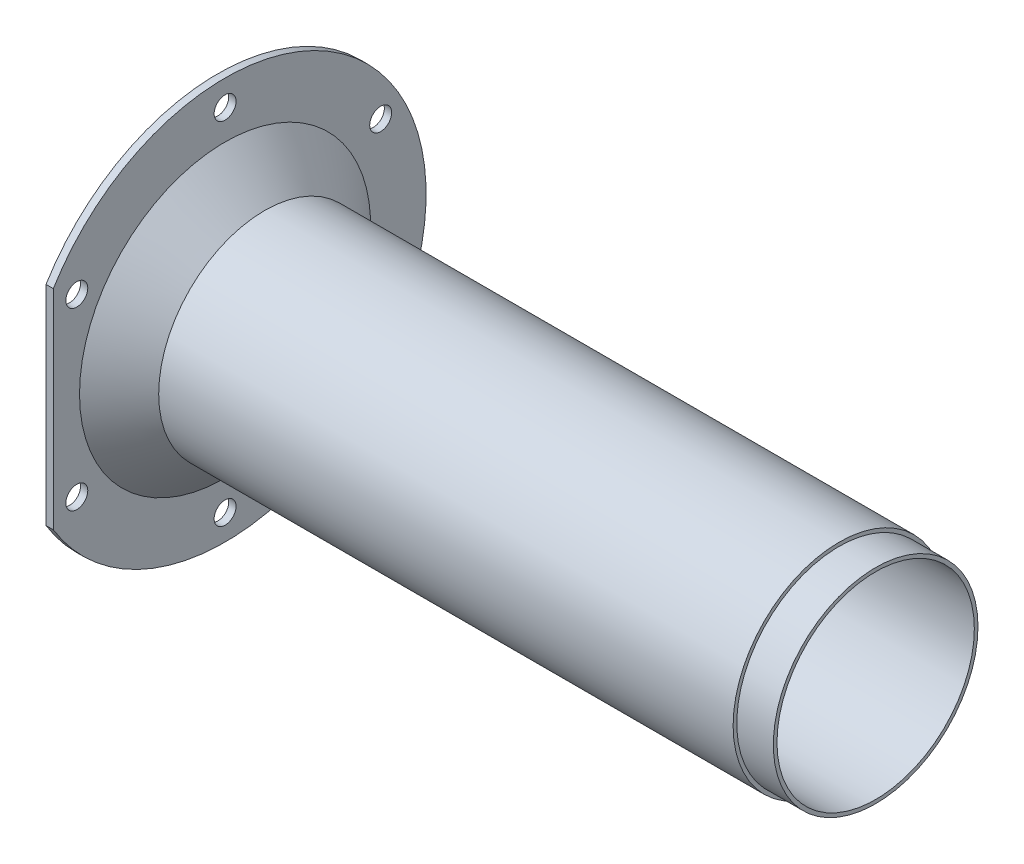
ISO-10303-21;
HEADER;
FILE_DESCRIPTION(('STEP AP214'),'2;1');
FILE_NAME('part.step','',(''),(''),'','','');
FILE_SCHEMA(('AUTOMOTIVE_DESIGN { 1 0 10303 214 1 1 1 1 }'));
ENDSEC;
DATA;
#1=APPLICATION_CONTEXT('core data for automotive mechanical design processes');
#2=APPLICATION_PROTOCOL_DEFINITION('international standard','automotive_design',2000,#1);
#3=PRODUCT_CONTEXT('',#1,'mechanical');
#4=PRODUCT('Part','Part','',(#3));
#5=PRODUCT_RELATED_PRODUCT_CATEGORY('part','',(#4));
#6=PRODUCT_DEFINITION_FORMATION('','',#4);
#7=PRODUCT_DEFINITION_CONTEXT('part definition',#1,'design');
#8=PRODUCT_DEFINITION('design','',#6,#7);
#9=PRODUCT_DEFINITION_SHAPE('','',#8);
#10=(LENGTH_UNIT() NAMED_UNIT(*) SI_UNIT(.MILLI.,.METRE.));
#11=(NAMED_UNIT(*) PLANE_ANGLE_UNIT() SI_UNIT($,.RADIAN.));
#12=(NAMED_UNIT(*) SI_UNIT($,.STERADIAN.) SOLID_ANGLE_UNIT());
#13=UNCERTAINTY_MEASURE_WITH_UNIT(LENGTH_MEASURE(1.E-05),#10,'distance_accuracy_value','');
#14=(GEOMETRIC_REPRESENTATION_CONTEXT(3) GLOBAL_UNCERTAINTY_ASSIGNED_CONTEXT((#13)) GLOBAL_UNIT_ASSIGNED_CONTEXT((#10,
#11,#12)) REPRESENTATION_CONTEXT('',''));
#15=CARTESIAN_POINT('',(0.,0.,0.));
#16=DIRECTION('',(0.,0.,1.));
#17=DIRECTION('',(1.,0.,0.));
#18=AXIS2_PLACEMENT_3D('',#15,#16,#17);
#19=CARTESIAN_POINT('',(-4.45390252457045E-13,0.,0.));
#20=DIRECTION('',(-1.,0.,0.));
#21=DIRECTION('',(0.,0.,1.));
#22=AXIS2_PLACEMENT_3D('',#19,#20,#21);
#23=CONICAL_SURFACE('',#22,19.4999999999996,0.7853981633973);
#24=CARTESIAN_POINT('',(6.,0.,0.));
#25=DIRECTION('',(1.,0.,0.));
#26=DIRECTION('',(0.,0.,-1.));
#27=AXIS2_PLACEMENT_3D('',#24,#25,#26);
#28=CIRCLE('',#27,13.5);
#29=CARTESIAN_POINT('',(6.,0.,-13.5));
#30=VERTEX_POINT('',#29);
#31=EDGE_CURVE('E52',#30,#30,#28,.T.);
#32=ORIENTED_EDGE('',*,*,#31,.T.);
#33=EDGE_LOOP('',(#32));
#34=FACE_BOUND('',#33,.T.);
#35=CARTESIAN_POINT('',(-4.44089209850063E-13,0.,0.));
#36=DIRECTION('',(-1.,0.,0.));
#37=DIRECTION('',(0.,0.,1.));
#38=AXIS2_PLACEMENT_3D('',#35,#36,#37);
#39=CIRCLE('',#38,19.4999999999996);
#40=CARTESIAN_POINT('',(-4.44089209850063E-13,0.,19.4999999999996));
#41=VERTEX_POINT('',#40);
#42=EDGE_CURVE('E20',#41,#41,#39,.T.);
#43=ORIENTED_EDGE('',*,*,#42,.T.);
#44=EDGE_LOOP('',(#43));
#45=FACE_BOUND('',#44,.T.);
#46=ADVANCED_FACE('F17',(#34,#45),#23,.F.);
#47=CARTESIAN_POINT('',(0.,0.,0.));
#48=DIRECTION('',(1.,0.,0.));
#49=DIRECTION('',(0.,0.,-1.));
#50=AXIS2_PLACEMENT_3D('',#47,#48,#49);
#51=PLANE('',#50);
#52=CARTESIAN_POINT('',(0.,-12.,20.28460969083));
#53=DIRECTION('',(1.,0.,0.));
#54=DIRECTION('',(0.,0.,-1.));
#55=AXIS2_PLACEMENT_3D('',#52,#53,#54);
#56=CIRCLE('',#55,1.5);
#57=CARTESIAN_POINT('',(0.,-12.,18.78460969083));
#58=VERTEX_POINT('',#57);
#59=EDGE_CURVE('E97',#58,#58,#56,.T.);
#60=ORIENTED_EDGE('',*,*,#59,.T.);
#61=EDGE_LOOP('',(#60));
#62=FACE_BOUND('',#61,.T.);
#63=CARTESIAN_POINT('',(0.,12.,20.28460969083));
#64=DIRECTION('',(1.,0.,0.));
#65=DIRECTION('',(0.,0.,-1.));
#66=AXIS2_PLACEMENT_3D('',#63,#64,#65);
#67=CIRCLE('',#66,1.5);
#68=CARTESIAN_POINT('',(0.,12.,18.78460969083));
#69=VERTEX_POINT('',#68);
#70=EDGE_CURVE('E100',#69,#69,#67,.T.);
#71=ORIENTED_EDGE('',*,*,#70,.T.);
#72=EDGE_LOOP('',(#71));
#73=FACE_BOUND('',#72,.T.);
#74=CARTESIAN_POINT('',(0.,23.9947911014,0.));
#75=DIRECTION('',(1.,0.,0.));
#76=DIRECTION('',(0.,0.,-1.));
#77=AXIS2_PLACEMENT_3D('',#74,#75,#76);
#78=CIRCLE('',#77,1.5);
#79=CARTESIAN_POINT('',(0.,23.9947911014,-1.5));
#80=VERTEX_POINT('',#79);
#81=EDGE_CURVE('E103',#80,#80,#78,.T.);
#82=ORIENTED_EDGE('',*,*,#81,.T.);
#83=EDGE_LOOP('',(#82));
#84=FACE_BOUND('',#83,.T.);
#85=CARTESIAN_POINT('',(0.,12.,-21.28460969083));
#86=DIRECTION('',(1.,0.,0.));
#87=DIRECTION('',(0.,0.,-1.));
#88=AXIS2_PLACEMENT_3D('',#85,#86,#87);
#89=CIRCLE('',#88,1.5);
#90=CARTESIAN_POINT('',(0.,12.,-22.78460969083));
#91=VERTEX_POINT('',#90);
#92=EDGE_CURVE('E106',#91,#91,#89,.T.);
#93=ORIENTED_EDGE('',*,*,#92,.T.);
#94=EDGE_LOOP('',(#93));
#95=FACE_BOUND('',#94,.T.);
#96=CARTESIAN_POINT('',(0.,-12.,-21.28460969083));
#97=DIRECTION('',(1.,0.,0.));
#98=DIRECTION('',(0.,0.,-1.));
#99=AXIS2_PLACEMENT_3D('',#96,#97,#98);
#100=CIRCLE('',#99,1.5);
#101=CARTESIAN_POINT('',(0.,-12.,-22.78460969083));
#102=VERTEX_POINT('',#101);
#103=EDGE_CURVE('E109',#102,#102,#100,.T.);
#104=ORIENTED_EDGE('',*,*,#103,.T.);
#105=EDGE_LOOP('',(#104));
#106=FACE_BOUND('',#105,.T.);
#107=CARTESIAN_POINT('',(0.,-23.9947911014,0.));
#108=DIRECTION('',(1.,0.,0.));
#109=DIRECTION('',(0.,0.,-1.));
#110=AXIS2_PLACEMENT_3D('',#107,#108,#109);
#111=CIRCLE('',#110,1.5);
#112=CARTESIAN_POINT('',(0.,-23.9947911014,-1.5));
#113=VERTEX_POINT('',#112);
#114=EDGE_CURVE('E58',#113,#113,#111,.T.);
#115=ORIENTED_EDGE('',*,*,#114,.T.);
#116=EDGE_LOOP('',(#115));
#117=FACE_BOUND('',#116,.T.);
#118=ORIENTED_EDGE('',*,*,#42,.F.);
#119=EDGE_LOOP('',(#118));
#120=FACE_BOUND('',#119,.T.);
#121=DIRECTION('',(0.,1.,0.));
#122=VECTOR('',#121,1.);
#123=CARTESIAN_POINT('',(0.,-14.28285685709,23.5));
#124=LINE('',#123,#122);
#125=CARTESIAN_POINT('',(0.,-14.2828568570878,23.5));
#126=VERTEX_POINT('',#125);
#127=CARTESIAN_POINT('',(0.,14.2828568570878,23.5));
#128=VERTEX_POINT('',#127);
#129=EDGE_CURVE('E45',#126,#128,#124,.T.);
#130=ORIENTED_EDGE('',*,*,#129,.T.);
#131=CARTESIAN_POINT('',(0.,0.,0.));
#132=DIRECTION('',(1.,0.,0.));
#133=DIRECTION('',(0.,0.,-1.));
#134=AXIS2_PLACEMENT_3D('',#131,#132,#133);
#135=CIRCLE('',#134,27.5);
#136=EDGE_CURVE('E42',#126,#128,#135,.T.);
#137=ORIENTED_EDGE('',*,*,#136,.F.);
#138=EDGE_LOOP('',(#130,#137));
#139=FACE_BOUND('',#138,.T.);
#140=ADVANCED_FACE('F46',(#62,#73,#84,#95,#106,#117,#120,#139),#51,.F.);
#141=CARTESIAN_POINT('',(-4.5,0.,0.));
#142=DIRECTION('',(1.,0.,0.));
#143=DIRECTION('',(0.,0.,-1.));
#144=AXIS2_PLACEMENT_3D('',#141,#142,#143);
#145=CYLINDRICAL_SURFACE('',#144,13.5);
#146=CARTESIAN_POINT('',(90.,0.,0.));
#147=DIRECTION('',(1.,0.,0.));
#148=DIRECTION('',(0.,0.,-1.));
#149=AXIS2_PLACEMENT_3D('',#146,#147,#148);
#150=CIRCLE('',#149,13.5);
#151=CARTESIAN_POINT('',(90.,0.,-13.5));
#152=VERTEX_POINT('',#151);
#153=EDGE_CURVE('E94',#152,#152,#150,.F.);
#154=ORIENTED_EDGE('',*,*,#153,.F.);
#155=EDGE_LOOP('',(#154));
#156=FACE_BOUND('',#155,.T.);
#157=ORIENTED_EDGE('',*,*,#31,.F.);
#158=EDGE_LOOP('',(#157));
#159=FACE_BOUND('',#158,.T.);
#160=ADVANCED_FACE('F182',(#156,#159),#145,.F.);
#161=CARTESIAN_POINT('',(-4.5,0.,0.));
#162=DIRECTION('',(1.,0.,0.));
#163=DIRECTION('',(0.,0.,-1.));
#164=AXIS2_PLACEMENT_3D('',#161,#162,#163);
#165=CYLINDRICAL_SURFACE('',#164,27.5);
#166=DIRECTION('',(-1.,0.,0.));
#167=VECTOR('',#166,1.);
#168=CARTESIAN_POINT('',(1.,-14.28285685709,23.5));
#169=LINE('',#168,#167);
#170=CARTESIAN_POINT('',(1.,-14.2828568570878,23.5));
#171=VERTEX_POINT('',#170);
#172=EDGE_CURVE('E51',#171,#126,#169,.T.);
#173=ORIENTED_EDGE('',*,*,#172,.T.);
#174=ORIENTED_EDGE('',*,*,#136,.T.);
#175=DIRECTION('',(-1.,0.,0.));
#176=VECTOR('',#175,1.);
#177=CARTESIAN_POINT('',(1.,14.28285685709,23.5));
#178=LINE('',#177,#176);
#179=CARTESIAN_POINT('',(1.,14.2828568570878,23.5));
#180=VERTEX_POINT('',#179);
#181=EDGE_CURVE('E35',#128,#180,#178,.F.);
#182=ORIENTED_EDGE('',*,*,#181,.T.);
#183=CARTESIAN_POINT('',(1.,0.,0.));
#184=DIRECTION('',(1.,0.,0.));
#185=DIRECTION('',(0.,0.,-1.));
#186=AXIS2_PLACEMENT_3D('',#183,#184,#185);
#187=CIRCLE('',#186,27.5);
#188=EDGE_CURVE('E92',#171,#180,#187,.T.);
#189=ORIENTED_EDGE('',*,*,#188,.F.);
#190=EDGE_LOOP('',(#173,#174,#182,#189));
#191=FACE_BOUND('',#190,.T.);
#192=ADVANCED_FACE('F50',(#191),#165,.T.);
#193=CARTESIAN_POINT('',(1.,-14.28285685709,23.5));
#194=DIRECTION('',(0.,0.,-1.));
#195=DIRECTION('',(-1.,0.,0.));
#196=AXIS2_PLACEMENT_3D('',#193,#194,#195);
#197=PLANE('',#196);
#198=DIRECTION('',(0.,1.,0.));
#199=VECTOR('',#198,1.);
#200=CARTESIAN_POINT('',(1.,0.,23.5));
#201=LINE('',#200,#199);
#202=EDGE_CURVE('E55',#180,#171,#201,.F.);
#203=ORIENTED_EDGE('',*,*,#202,.F.);
#204=ORIENTED_EDGE('',*,*,#181,.F.);
#205=ORIENTED_EDGE('',*,*,#129,.F.);
#206=ORIENTED_EDGE('',*,*,#172,.F.);
#207=EDGE_LOOP('',(#203,#204,#205,#206));
#208=FACE_BOUND('',#207,.T.);
#209=ADVANCED_FACE('F53',(#208),#197,.F.);
#210=CARTESIAN_POINT('',(1.,-23.9947911014,0.));
#211=DIRECTION('',(1.,0.,0.));
#212=DIRECTION('',(0.,0.,-1.));
#213=AXIS2_PLACEMENT_3D('',#210,#211,#212);
#214=CYLINDRICAL_SURFACE('',#213,1.5);
#215=CARTESIAN_POINT('',(1.,-23.9947911014,0.));
#216=DIRECTION('',(1.,0.,0.));
#217=DIRECTION('',(0.,0.,-1.));
#218=AXIS2_PLACEMENT_3D('',#215,#216,#217);
#219=CIRCLE('',#218,1.5);
#220=CARTESIAN_POINT('',(1.,-23.9947911014,-1.5));
#221=VERTEX_POINT('',#220);
#222=EDGE_CURVE('E89',#221,#221,#219,.F.);
#223=ORIENTED_EDGE('',*,*,#222,.F.);
#224=EDGE_LOOP('',(#223));
#225=FACE_BOUND('',#224,.T.);
#226=ORIENTED_EDGE('',*,*,#114,.F.);
#227=EDGE_LOOP('',(#226));
#228=FACE_BOUND('',#227,.T.);
#229=ADVANCED_FACE('F117',(#225,#228),#214,.F.);
#230=CARTESIAN_POINT('',(1.,-12.,-21.28460969083));
#231=DIRECTION('',(1.,0.,0.));
#232=DIRECTION('',(0.,0.,-1.));
#233=AXIS2_PLACEMENT_3D('',#230,#231,#232);
#234=CYLINDRICAL_SURFACE('',#233,1.5);
#235=CARTESIAN_POINT('',(1.,-12.,-21.28460969083));
#236=DIRECTION('',(1.,0.,0.));
#237=DIRECTION('',(0.,0.,-1.));
#238=AXIS2_PLACEMENT_3D('',#235,#236,#237);
#239=CIRCLE('',#238,1.5);
#240=CARTESIAN_POINT('',(1.,-12.,-22.78460969083));
#241=VERTEX_POINT('',#240);
#242=EDGE_CURVE('E86',#241,#241,#239,.F.);
#243=ORIENTED_EDGE('',*,*,#242,.F.);
#244=EDGE_LOOP('',(#243));
#245=FACE_BOUND('',#244,.T.);
#246=ORIENTED_EDGE('',*,*,#103,.F.);
#247=EDGE_LOOP('',(#246));
#248=FACE_BOUND('',#247,.T.);
#249=ADVANCED_FACE('F119',(#245,#248),#234,.F.);
#250=CARTESIAN_POINT('',(1.,12.,-21.28460969083));
#251=DIRECTION('',(1.,0.,0.));
#252=DIRECTION('',(0.,0.,-1.));
#253=AXIS2_PLACEMENT_3D('',#250,#251,#252);
#254=CYLINDRICAL_SURFACE('',#253,1.5);
#255=CARTESIAN_POINT('',(1.,12.,-21.28460969083));
#256=DIRECTION('',(1.,0.,0.));
#257=DIRECTION('',(0.,0.,-1.));
#258=AXIS2_PLACEMENT_3D('',#255,#256,#257);
#259=CIRCLE('',#258,1.5);
#260=CARTESIAN_POINT('',(1.,12.,-22.78460969083));
#261=VERTEX_POINT('',#260);
#262=EDGE_CURVE('E83',#261,#261,#259,.F.);
#263=ORIENTED_EDGE('',*,*,#262,.F.);
#264=EDGE_LOOP('',(#263));
#265=FACE_BOUND('',#264,.T.);
#266=ORIENTED_EDGE('',*,*,#92,.F.);
#267=EDGE_LOOP('',(#266));
#268=FACE_BOUND('',#267,.T.);
#269=ADVANCED_FACE('F127',(#265,#268),#254,.F.);
#270=CARTESIAN_POINT('',(1.,23.9947911014,0.));
#271=DIRECTION('',(1.,0.,0.));
#272=DIRECTION('',(0.,0.,-1.));
#273=AXIS2_PLACEMENT_3D('',#270,#271,#272);
#274=CYLINDRICAL_SURFACE('',#273,1.5);
#275=CARTESIAN_POINT('',(1.,23.9947911014,0.));
#276=DIRECTION('',(1.,0.,0.));
#277=DIRECTION('',(0.,0.,-1.));
#278=AXIS2_PLACEMENT_3D('',#275,#276,#277);
#279=CIRCLE('',#278,1.5);
#280=CARTESIAN_POINT('',(1.,23.9947911014,-1.5));
#281=VERTEX_POINT('',#280);
#282=EDGE_CURVE('E80',#281,#281,#279,.F.);
#283=ORIENTED_EDGE('',*,*,#282,.F.);
#284=EDGE_LOOP('',(#283));
#285=FACE_BOUND('',#284,.T.);
#286=ORIENTED_EDGE('',*,*,#81,.F.);
#287=EDGE_LOOP('',(#286));
#288=FACE_BOUND('',#287,.T.);
#289=ADVANCED_FACE('F167',(#285,#288),#274,.F.);
#290=CARTESIAN_POINT('',(1.,12.,20.28460969083));
#291=DIRECTION('',(1.,0.,0.));
#292=DIRECTION('',(0.,0.,-1.));
#293=AXIS2_PLACEMENT_3D('',#290,#291,#292);
#294=CYLINDRICAL_SURFACE('',#293,1.5);
#295=CARTESIAN_POINT('',(1.,12.,20.28460969083));
#296=DIRECTION('',(1.,0.,0.));
#297=DIRECTION('',(0.,0.,-1.));
#298=AXIS2_PLACEMENT_3D('',#295,#296,#297);
#299=CIRCLE('',#298,1.5);
#300=CARTESIAN_POINT('',(1.,12.,18.78460969083));
#301=VERTEX_POINT('',#300);
#302=EDGE_CURVE('E77',#301,#301,#299,.F.);
#303=ORIENTED_EDGE('',*,*,#302,.F.);
#304=EDGE_LOOP('',(#303));
#305=FACE_BOUND('',#304,.T.);
#306=ORIENTED_EDGE('',*,*,#70,.F.);
#307=EDGE_LOOP('',(#306));
#308=FACE_BOUND('',#307,.T.);
#309=ADVANCED_FACE('F163',(#305,#308),#294,.F.);
#310=CARTESIAN_POINT('',(1.,-12.,20.28460969083));
#311=DIRECTION('',(1.,0.,0.));
#312=DIRECTION('',(0.,0.,-1.));
#313=AXIS2_PLACEMENT_3D('',#310,#311,#312);
#314=CYLINDRICAL_SURFACE('',#313,1.5);
#315=CARTESIAN_POINT('',(1.,-12.,20.28460969083));
#316=DIRECTION('',(1.,0.,0.));
#317=DIRECTION('',(0.,0.,-1.));
#318=AXIS2_PLACEMENT_3D('',#315,#316,#317);
#319=CIRCLE('',#318,1.5);
#320=CARTESIAN_POINT('',(1.,-12.,18.78460969083));
#321=VERTEX_POINT('',#320);
#322=EDGE_CURVE('E74',#321,#321,#319,.F.);
#323=ORIENTED_EDGE('',*,*,#322,.F.);
#324=EDGE_LOOP('',(#323));
#325=FACE_BOUND('',#324,.T.);
#326=ORIENTED_EDGE('',*,*,#59,.F.);
#327=EDGE_LOOP('',(#326));
#328=FACE_BOUND('',#327,.T.);
#329=ADVANCED_FACE('F159',(#325,#328),#314,.F.);
#330=CARTESIAN_POINT('',(90.,0.,0.));
#331=DIRECTION('',(1.,0.,0.));
#332=DIRECTION('',(0.,0.,-1.));
#333=AXIS2_PLACEMENT_3D('',#330,#331,#332);
#334=PLANE('',#333);
#335=ORIENTED_EDGE('',*,*,#153,.T.);
#336=EDGE_LOOP('',(#335));
#337=FACE_BOUND('',#336,.T.);
#338=CARTESIAN_POINT('',(90.,0.,0.));
#339=DIRECTION('',(1.,0.,0.));
#340=DIRECTION('',(0.,0.,-1.));
#341=AXIS2_PLACEMENT_3D('',#338,#339,#340);
#342=CIRCLE('',#341,14.);
#343=CARTESIAN_POINT('',(90.,0.,-14.));
#344=VERTEX_POINT('',#343);
#345=EDGE_CURVE('E71',#344,#344,#342,.F.);
#346=ORIENTED_EDGE('',*,*,#345,.F.);
#347=EDGE_LOOP('',(#346));
#348=FACE_BOUND('',#347,.T.);
#349=ADVANCED_FACE('F155',(#337,#348),#334,.T.);
#350=CARTESIAN_POINT('',(1.,0.,0.));
#351=DIRECTION('',(1.,0.,0.));
#352=DIRECTION('',(0.,0.,-1.));
#353=AXIS2_PLACEMENT_3D('',#350,#351,#352);
#354=PLANE('',#353);
#355=ORIENTED_EDGE('',*,*,#322,.T.);
#356=EDGE_LOOP('',(#355));
#357=FACE_BOUND('',#356,.T.);
#358=ORIENTED_EDGE('',*,*,#302,.T.);
#359=EDGE_LOOP('',(#358));
#360=FACE_BOUND('',#359,.T.);
#361=ORIENTED_EDGE('',*,*,#282,.T.);
#362=EDGE_LOOP('',(#361));
#363=FACE_BOUND('',#362,.T.);
#364=ORIENTED_EDGE('',*,*,#262,.T.);
#365=EDGE_LOOP('',(#364));
#366=FACE_BOUND('',#365,.T.);
#367=ORIENTED_EDGE('',*,*,#242,.T.);
#368=EDGE_LOOP('',(#367));
#369=FACE_BOUND('',#368,.T.);
#370=ORIENTED_EDGE('',*,*,#222,.T.);
#371=EDGE_LOOP('',(#370));
#372=FACE_BOUND('',#371,.T.);
#373=CARTESIAN_POINT('',(1.0000000000031,0.,0.));
#374=DIRECTION('',(-1.,0.,0.));
#375=DIRECTION('',(0.,0.,1.));
#376=AXIS2_PLACEMENT_3D('',#373,#374,#375);
#377=CIRCLE('',#376,19.9142135623731);
#378=CARTESIAN_POINT('',(1.0000000000031,0.,19.9142135623731));
#379=VERTEX_POINT('',#378);
#380=EDGE_CURVE('E68',#379,#379,#377,.F.);
#381=ORIENTED_EDGE('',*,*,#380,.F.);
#382=EDGE_LOOP('',(#381));
#383=FACE_BOUND('',#382,.T.);
#384=ORIENTED_EDGE('',*,*,#188,.T.);
#385=ORIENTED_EDGE('',*,*,#202,.T.);
#386=EDGE_LOOP('',(#384,#385));
#387=FACE_BOUND('',#386,.T.);
#388=ADVANCED_FACE('F151',(#357,#360,#363,#366,#369,#372,#383,#387),#354,.T.);
#389=CARTESIAN_POINT('',(-4.5,0.,0.));
#390=DIRECTION('',(1.,0.,0.));
#391=DIRECTION('',(0.,0.,-1.));
#392=AXIS2_PLACEMENT_3D('',#389,#390,#391);
#393=CYLINDRICAL_SURFACE('',#392,14.);
#394=CARTESIAN_POINT('',(85.,0.,0.));
#395=DIRECTION('',(1.,0.,0.));
#396=DIRECTION('',(0.,0.,-1.));
#397=AXIS2_PLACEMENT_3D('',#394,#395,#396);
#398=CIRCLE('',#397,14.);
#399=CARTESIAN_POINT('',(85.,0.,-14.));
#400=VERTEX_POINT('',#399);
#401=EDGE_CURVE('E65',#400,#400,#398,.F.);
#402=ORIENTED_EDGE('',*,*,#401,.F.);
#403=EDGE_LOOP('',(#402));
#404=FACE_BOUND('',#403,.T.);
#405=ORIENTED_EDGE('',*,*,#345,.T.);
#406=EDGE_LOOP('',(#405));
#407=FACE_BOUND('',#406,.T.);
#408=ADVANCED_FACE('F147',(#404,#407),#393,.T.);
#409=CARTESIAN_POINT('',(1.0000000000031,0.,0.));
#410=DIRECTION('',(-1.,0.,0.));
#411=DIRECTION('',(0.,0.,1.));
#412=AXIS2_PLACEMENT_3D('',#409,#410,#411);
#413=CONICAL_SURFACE('',#412,19.9142135623731,0.7853981633973);
#414=CARTESIAN_POINT('',(6.414213562373,0.,0.));
#415=DIRECTION('',(1.,0.,0.));
#416=DIRECTION('',(0.,0.,-1.));
#417=AXIS2_PLACEMENT_3D('',#414,#415,#416);
#418=CIRCLE('',#417,14.5);
#419=CARTESIAN_POINT('',(6.414213562373,0.,-14.5));
#420=VERTEX_POINT('',#419);
#421=EDGE_CURVE('E26',#420,#420,#418,.T.);
#422=ORIENTED_EDGE('',*,*,#421,.F.);
#423=EDGE_LOOP('',(#422));
#424=FACE_BOUND('',#423,.T.);
#425=ORIENTED_EDGE('',*,*,#380,.T.);
#426=EDGE_LOOP('',(#425));
#427=FACE_BOUND('',#426,.T.);
#428=ADVANCED_FACE('F140',(#424,#427),#413,.T.);
#429=CARTESIAN_POINT('',(85.,0.,0.));
#430=DIRECTION('',(1.,0.,0.));
#431=DIRECTION('',(0.,0.,-1.));
#432=AXIS2_PLACEMENT_3D('',#429,#430,#431);
#433=PLANE('',#432);
#434=ORIENTED_EDGE('',*,*,#401,.T.);
#435=EDGE_LOOP('',(#434));
#436=FACE_BOUND('',#435,.T.);
#437=CARTESIAN_POINT('',(85.,0.,0.));
#438=DIRECTION('',(1.,0.,0.));
#439=DIRECTION('',(0.,0.,-1.));
#440=AXIS2_PLACEMENT_3D('',#437,#438,#439);
#441=CIRCLE('',#440,14.5);
#442=CARTESIAN_POINT('',(85.,0.,-14.5));
#443=VERTEX_POINT('',#442);
#444=EDGE_CURVE('E11',#443,#443,#441,.F.);
#445=ORIENTED_EDGE('',*,*,#444,.F.);
#446=EDGE_LOOP('',(#445));
#447=FACE_BOUND('',#446,.T.);
#448=ADVANCED_FACE('F134',(#436,#447),#433,.T.);
#449=CARTESIAN_POINT('',(-4.5,0.,0.));
#450=DIRECTION('',(1.,0.,0.));
#451=DIRECTION('',(0.,0.,-1.));
#452=AXIS2_PLACEMENT_3D('',#449,#450,#451);
#453=CYLINDRICAL_SURFACE('',#452,14.5);
#454=ORIENTED_EDGE('',*,*,#444,.T.);
#455=EDGE_LOOP('',(#454));
#456=FACE_BOUND('',#455,.T.);
#457=ORIENTED_EDGE('',*,*,#421,.T.);
#458=EDGE_LOOP('',(#457));
#459=FACE_BOUND('',#458,.T.);
#460=ADVANCED_FACE('F132',(#456,#459),#453,.T.);
#461=CLOSED_SHELL('',(#46,#140,#160,#192,#209,#229,#249,#269,#289,#309,#329,#349,#388,#408,#428,
#448,#460));
#462=MANIFOLD_SOLID_BREP('B1',#461);
#463=ADVANCED_BREP_SHAPE_REPRESENTATION('',(#18,#462),#14);
#464=SHAPE_DEFINITION_REPRESENTATION(#9,#463);
ENDSEC;
END-ISO-10303-21;
